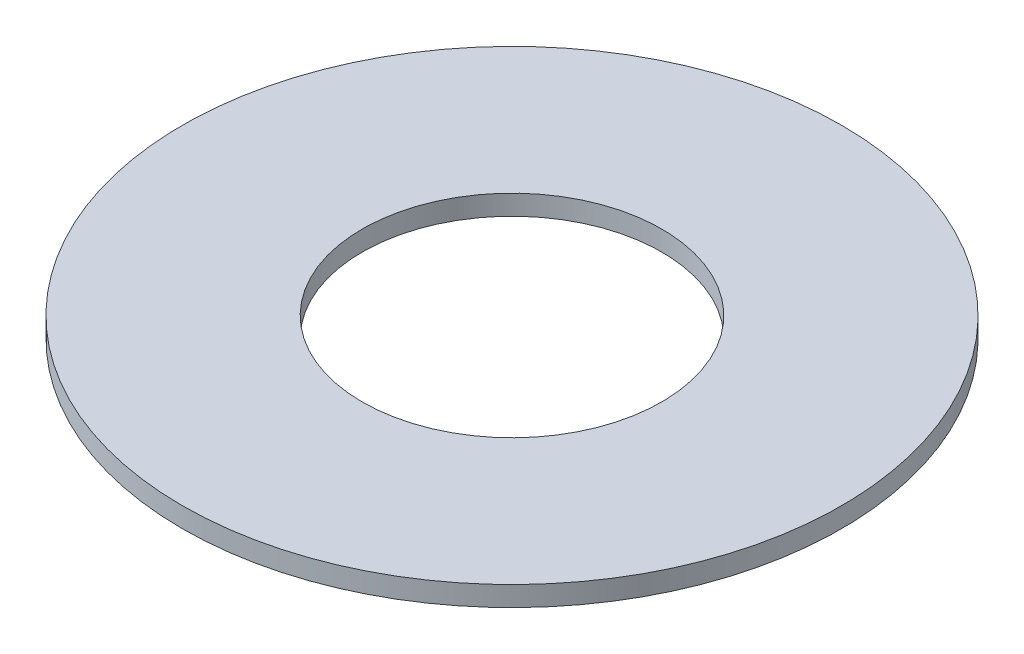
ISO-10303-21;
HEADER;
FILE_DESCRIPTION(('STEP AP214'),'2;1');
FILE_NAME('part.step','',(''),(''),'','','');
FILE_SCHEMA(('AUTOMOTIVE_DESIGN { 1 0 10303 214 1 1 1 1 }'));
ENDSEC;
DATA;
#1=APPLICATION_CONTEXT('core data for automotive mechanical design processes');
#2=APPLICATION_PROTOCOL_DEFINITION('international standard','automotive_design',2000,#1);
#3=PRODUCT_CONTEXT('',#1,'mechanical');
#4=PRODUCT('Part','Part','',(#3));
#5=PRODUCT_RELATED_PRODUCT_CATEGORY('part','',(#4));
#6=PRODUCT_DEFINITION_FORMATION('','',#4);
#7=PRODUCT_DEFINITION_CONTEXT('part definition',#1,'design');
#8=PRODUCT_DEFINITION('design','',#6,#7);
#9=PRODUCT_DEFINITION_SHAPE('','',#8);
#10=(LENGTH_UNIT() NAMED_UNIT(*) SI_UNIT(.MILLI.,.METRE.));
#11=(NAMED_UNIT(*) PLANE_ANGLE_UNIT() SI_UNIT($,.RADIAN.));
#12=(NAMED_UNIT(*) SI_UNIT($,.STERADIAN.) SOLID_ANGLE_UNIT());
#13=UNCERTAINTY_MEASURE_WITH_UNIT(LENGTH_MEASURE(1.E-05),#10,'distance_accuracy_value','');
#14=(GEOMETRIC_REPRESENTATION_CONTEXT(3) GLOBAL_UNCERTAINTY_ASSIGNED_CONTEXT((#13)) GLOBAL_UNIT_ASSIGNED_CONTEXT((#10,
#11,#12)) REPRESENTATION_CONTEXT('',''));
#15=CARTESIAN_POINT('',(0.,0.,0.));
#16=DIRECTION('',(0.,0.,1.));
#17=DIRECTION('',(1.,0.,0.));
#18=AXIS2_PLACEMENT_3D('',#15,#16,#17);
#19=CARTESIAN_POINT('',(0.,5.,0.));
#20=DIRECTION('',(0.,-1.,0.));
#21=DIRECTION('',(0.,0.,-1.));
#22=AXIS2_PLACEMENT_3D('',#19,#20,#21);
#23=CYLINDRICAL_SURFACE('',#22,82.5);
#24=CARTESIAN_POINT('',(0.,5.,0.));
#25=DIRECTION('',(0.,1.,0.));
#26=DIRECTION('',(0.,0.,1.));
#27=AXIS2_PLACEMENT_3D('',#24,#25,#26);
#28=CIRCLE('',#27,82.5);
#29=CARTESIAN_POINT('',(0.,5.,82.5));
#30=VERTEX_POINT('',#29);
#31=EDGE_CURVE('E10',#30,#30,#28,.T.);
#32=ORIENTED_EDGE('',*,*,#31,.F.);
#33=EDGE_LOOP('',(#32));
#34=FACE_BOUND('',#33,.T.);
#35=CARTESIAN_POINT('',(0.,0.,0.));
#36=DIRECTION('',(0.,1.,0.));
#37=DIRECTION('',(0.,0.,1.));
#38=AXIS2_PLACEMENT_3D('',#35,#36,#37);
#39=CIRCLE('',#38,82.5);
#40=CARTESIAN_POINT('',(0.,0.,82.5));
#41=VERTEX_POINT('',#40);
#42=EDGE_CURVE('E37',#41,#41,#39,.T.);
#43=ORIENTED_EDGE('',*,*,#42,.T.);
#44=EDGE_LOOP('',(#43));
#45=FACE_BOUND('',#44,.T.);
#46=ADVANCED_FACE('F40',(#34,#45),#23,.T.);
#47=CARTESIAN_POINT('',(0.,5.,0.));
#48=DIRECTION('',(0.,1.,0.));
#49=DIRECTION('',(0.,0.,1.));
#50=AXIS2_PLACEMENT_3D('',#47,#48,#49);
#51=PLANE('',#50);
#52=CARTESIAN_POINT('',(0.,5.,0.));
#53=DIRECTION('',(0.,1.,0.));
#54=DIRECTION('',(0.,0.,1.));
#55=AXIS2_PLACEMENT_3D('',#52,#53,#54);
#56=CIRCLE('',#55,37.5);
#57=CARTESIAN_POINT('',(0.,5.,37.5));
#58=VERTEX_POINT('',#57);
#59=EDGE_CURVE('E50',#58,#58,#56,.T.);
#60=ORIENTED_EDGE('',*,*,#59,.F.);
#61=EDGE_LOOP('',(#60));
#62=FACE_BOUND('',#61,.T.);
#63=ORIENTED_EDGE('',*,*,#31,.T.);
#64=EDGE_LOOP('',(#63));
#65=FACE_BOUND('',#64,.T.);
#66=ADVANCED_FACE('F59',(#62,#65),#51,.T.);
#67=CARTESIAN_POINT('',(0.,0.,0.));
#68=DIRECTION('',(0.,1.,0.));
#69=DIRECTION('',(0.,0.,1.));
#70=AXIS2_PLACEMENT_3D('',#67,#68,#69);
#71=PLANE('',#70);
#72=CARTESIAN_POINT('',(0.,0.,0.));
#73=DIRECTION('',(0.,1.,0.));
#74=DIRECTION('',(0.,0.,1.));
#75=AXIS2_PLACEMENT_3D('',#72,#73,#74);
#76=CIRCLE('',#75,37.5);
#77=CARTESIAN_POINT('',(0.,0.,37.5));
#78=VERTEX_POINT('',#77);
#79=EDGE_CURVE('E47',#78,#78,#76,.T.);
#80=ORIENTED_EDGE('',*,*,#79,.T.);
#81=EDGE_LOOP('',(#80));
#82=FACE_BOUND('',#81,.T.);
#83=ORIENTED_EDGE('',*,*,#42,.F.);
#84=EDGE_LOOP('',(#83));
#85=FACE_BOUND('',#84,.T.);
#86=ADVANCED_FACE('F58',(#82,#85),#71,.F.);
#87=CARTESIAN_POINT('',(0.,5.,0.));
#88=DIRECTION('',(0.,-1.,0.));
#89=DIRECTION('',(0.,0.,-1.));
#90=AXIS2_PLACEMENT_3D('',#87,#88,#89);
#91=CYLINDRICAL_SURFACE('',#90,37.5);
#92=ORIENTED_EDGE('',*,*,#59,.T.);
#93=EDGE_LOOP('',(#92));
#94=FACE_BOUND('',#93,.T.);
#95=ORIENTED_EDGE('',*,*,#79,.F.);
#96=EDGE_LOOP('',(#95));
#97=FACE_BOUND('',#96,.T.);
#98=ADVANCED_FACE('F54',(#94,#97),#91,.F.);
#99=CLOSED_SHELL('',(#46,#66,#86,#98));
#100=MANIFOLD_SOLID_BREP('B2',#99);
#101=ADVANCED_BREP_SHAPE_REPRESENTATION('',(#18,#100),#14);
#102=SHAPE_DEFINITION_REPRESENTATION(#9,#101);
ENDSEC;
END-ISO-10303-21;
